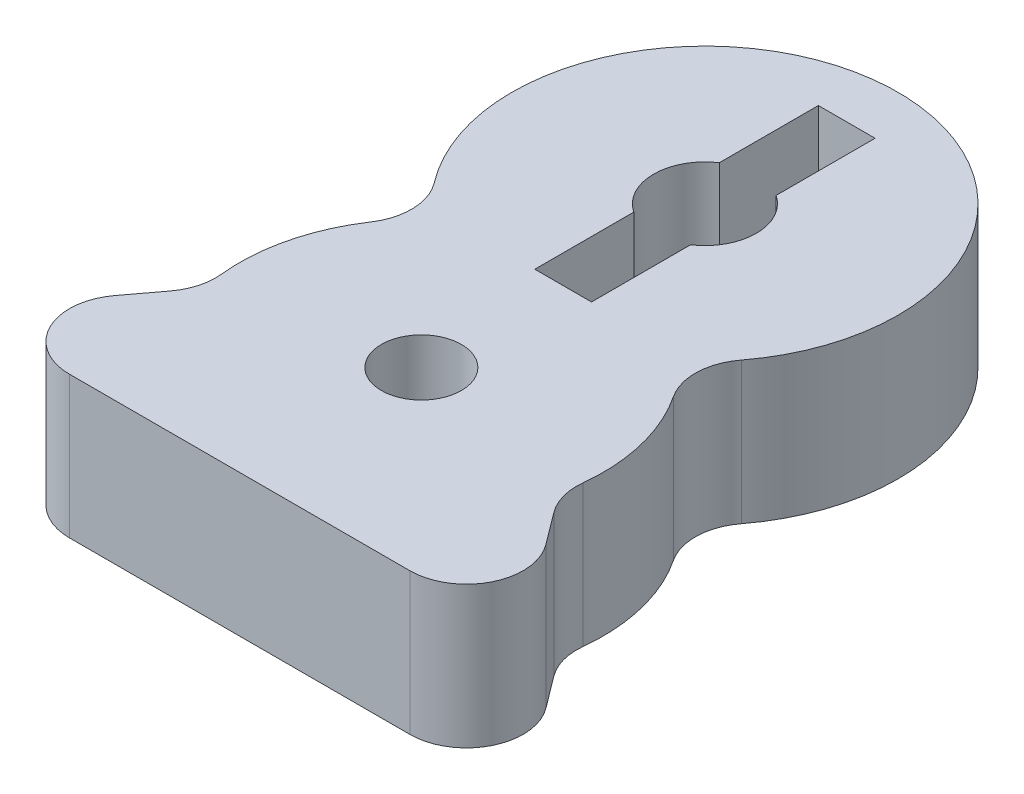
ISO-10303-21;
HEADER;
FILE_DESCRIPTION(('STEP AP214'),'2;1');
FILE_NAME('part.step','',(''),(''),'','','');
FILE_SCHEMA(('AUTOMOTIVE_DESIGN { 1 0 10303 214 1 1 1 1 }'));
ENDSEC;
DATA;
#1=APPLICATION_CONTEXT('core data for automotive mechanical design processes');
#2=APPLICATION_PROTOCOL_DEFINITION('international standard','automotive_design',2000,#1);
#3=PRODUCT_CONTEXT('',#1,'mechanical');
#4=PRODUCT('Part','Part','',(#3));
#5=PRODUCT_RELATED_PRODUCT_CATEGORY('part','',(#4));
#6=PRODUCT_DEFINITION_FORMATION('','',#4);
#7=PRODUCT_DEFINITION_CONTEXT('part definition',#1,'design');
#8=PRODUCT_DEFINITION('design','',#6,#7);
#9=PRODUCT_DEFINITION_SHAPE('','',#8);
#10=(LENGTH_UNIT() NAMED_UNIT(*) SI_UNIT(.MILLI.,.METRE.));
#11=(NAMED_UNIT(*) PLANE_ANGLE_UNIT() SI_UNIT($,.RADIAN.));
#12=(NAMED_UNIT(*) SI_UNIT($,.STERADIAN.) SOLID_ANGLE_UNIT());
#13=UNCERTAINTY_MEASURE_WITH_UNIT(LENGTH_MEASURE(1.E-05),#10,'distance_accuracy_value','');
#14=(GEOMETRIC_REPRESENTATION_CONTEXT(3) GLOBAL_UNCERTAINTY_ASSIGNED_CONTEXT((#13)) GLOBAL_UNIT_ASSIGNED_CONTEXT((#10,
#11,#12)) REPRESENTATION_CONTEXT('',''));
#15=CARTESIAN_POINT('',(0.,0.,0.));
#16=DIRECTION('',(0.,0.,1.));
#17=DIRECTION('',(1.,0.,0.));
#18=AXIS2_PLACEMENT_3D('',#15,#16,#17);
#19=CARTESIAN_POINT('',(0.,6.35,-12.7));
#20=DIRECTION('',(0.,-1.,0.));
#21=DIRECTION('',(0.,0.,-1.));
#22=AXIS2_PLACEMENT_3D('',#19,#20,#21);
#23=CYLINDRICAL_SURFACE('',#22,2.2987);
#24=DIRECTION('',(0.,-1.,0.));
#25=VECTOR('',#24,1.);
#26=CARTESIAN_POINT('',(1.27,6.35,-10.7839828575923));
#27=LINE('',#26,#25);
#28=CARTESIAN_POINT('',(1.27,6.35,-10.7839828575923));
#29=VERTEX_POINT('',#28);
#30=CARTESIAN_POINT('',(1.27,0.,-10.7839828575923));
#31=VERTEX_POINT('',#30);
#32=EDGE_CURVE('E11',#29,#31,#27,.T.);
#33=ORIENTED_EDGE('',*,*,#32,.F.);
#34=CARTESIAN_POINT('',(0.,6.35,-12.7));
#35=DIRECTION('',(0.,1.,0.));
#36=DIRECTION('',(0.,0.,1.));
#37=AXIS2_PLACEMENT_3D('',#34,#35,#36);
#38=CIRCLE('',#37,2.2987);
#39=CARTESIAN_POINT('',(1.27,6.35,-14.6160171424077));
#40=VERTEX_POINT('',#39);
#41=EDGE_CURVE('E213',#29,#40,#38,.T.);
#42=ORIENTED_EDGE('',*,*,#41,.T.);
#43=DIRECTION('',(0.,-1.,0.));
#44=VECTOR('',#43,1.);
#45=CARTESIAN_POINT('',(1.27,6.35,-14.6160171424077));
#46=LINE('',#45,#44);
#47=CARTESIAN_POINT('',(1.27,0.,-14.6160171424077));
#48=VERTEX_POINT('',#47);
#49=EDGE_CURVE('E41',#48,#40,#46,.F.);
#50=ORIENTED_EDGE('',*,*,#49,.F.);
#51=CARTESIAN_POINT('',(0.,0.,-12.7));
#52=DIRECTION('',(0.,1.,0.));
#53=DIRECTION('',(0.,0.,1.));
#54=AXIS2_PLACEMENT_3D('',#51,#52,#53);
#55=CIRCLE('',#54,2.2987);
#56=EDGE_CURVE('E217',#31,#48,#55,.T.);
#57=ORIENTED_EDGE('',*,*,#56,.F.);
#58=EDGE_LOOP('',(#33,#42,#50,#57));
#59=FACE_BOUND('',#58,.T.);
#60=ADVANCED_FACE('F33',(#59),#23,.F.);
#61=CARTESIAN_POINT('',(0.,6.35,0.));
#62=DIRECTION('',(0.,1.,0.));
#63=DIRECTION('',(0.,0.,1.));
#64=AXIS2_PLACEMENT_3D('',#61,#62,#63);
#65=PLANE('',#64);
#66=DIRECTION('',(0.,0.,-1.));
#67=VECTOR('',#66,1.);
#68=CARTESIAN_POINT('',(1.27,6.35,-19.05));
#69=LINE('',#68,#67);
#70=CARTESIAN_POINT('',(1.27,6.35,-6.35));
#71=VERTEX_POINT('',#70);
#72=EDGE_CURVE('E180',#71,#29,#69,.T.);
#73=ORIENTED_EDGE('',*,*,#72,.F.);
#74=DIRECTION('',(1.,0.,0.));
#75=VECTOR('',#74,1.);
#76=CARTESIAN_POINT('',(-1.27,6.35,-6.35));
#77=LINE('',#76,#75);
#78=CARTESIAN_POINT('',(-1.27,6.35,-6.35));
#79=VERTEX_POINT('',#78);
#80=EDGE_CURVE('E190',#79,#71,#77,.T.);
#81=ORIENTED_EDGE('',*,*,#80,.F.);
#82=DIRECTION('',(0.,0.,1.));
#83=VECTOR('',#82,1.);
#84=CARTESIAN_POINT('',(-1.27,6.35,-19.05));
#85=LINE('',#84,#83);
#86=CARTESIAN_POINT('',(-1.27,6.35,-10.7839828575923));
#87=VERTEX_POINT('',#86);
#88=EDGE_CURVE('E196',#87,#79,#85,.T.);
#89=ORIENTED_EDGE('',*,*,#88,.F.);
#90=CARTESIAN_POINT('',(-1.27,6.35,-14.6160171424077));
#91=VERTEX_POINT('',#90);
#92=EDGE_CURVE('E216',#91,#87,#38,.T.);
#93=ORIENTED_EDGE('',*,*,#92,.F.);
#94=CARTESIAN_POINT('',(-1.27,6.35,-19.05));
#95=VERTEX_POINT('',#94);
#96=EDGE_CURVE('E56',#95,#91,#85,.T.);
#97=ORIENTED_EDGE('',*,*,#96,.F.);
#98=DIRECTION('',(-1.,0.,0.));
#99=VECTOR('',#98,1.);
#100=CARTESIAN_POINT('',(-1.27,6.35,-19.05));
#101=LINE('',#100,#99);
#102=CARTESIAN_POINT('',(1.27,6.35,-19.05));
#103=VERTEX_POINT('',#102);
#104=EDGE_CURVE('E186',#103,#95,#101,.T.);
#105=ORIENTED_EDGE('',*,*,#104,.F.);
#106=EDGE_CURVE('E170',#40,#103,#69,.T.);
#107=ORIENTED_EDGE('',*,*,#106,.F.);
#108=ORIENTED_EDGE('',*,*,#41,.F.);
#109=EDGE_LOOP('',(#73,#81,#89,#93,#97,#105,#107,#108));
#110=FACE_BOUND('',#109,.T.);
#111=CARTESIAN_POINT('',(0.,6.35,0.));
#112=DIRECTION('',(0.,1.,0.));
#113=DIRECTION('',(0.,0.,1.));
#114=AXIS2_PLACEMENT_3D('',#111,#112,#113);
#115=CIRCLE('',#114,1.7907);
#116=CARTESIAN_POINT('',(0.,6.35,1.7907));
#117=VERTEX_POINT('',#116);
#118=EDGE_CURVE('E220',#117,#117,#115,.T.);
#119=ORIENTED_EDGE('',*,*,#118,.F.);
#120=EDGE_LOOP('',(#119));
#121=FACE_BOUND('',#120,.T.);
#122=DIRECTION('',(1.,0.,0.));
#123=VECTOR('',#122,1.);
#124=CARTESIAN_POINT('',(-12.7,6.35,8.1407));
#125=LINE('',#124,#123);
#126=CARTESIAN_POINT('',(-7.62243758102325,6.35,8.1407));
#127=VERTEX_POINT('',#126);
#128=CARTESIAN_POINT('',(7.62243758102325,6.35,8.1407));
#129=VERTEX_POINT('',#128);
#130=EDGE_CURVE('E229',#127,#129,#125,.T.);
#131=ORIENTED_EDGE('',*,*,#130,.T.);
#132=CARTESIAN_POINT('',(7.62243758102325,6.35,5.6007));
#133=DIRECTION('',(0.,1.,0.));
#134=DIRECTION('',(0.,0.,1.));
#135=AXIS2_PLACEMENT_3D('',#132,#133,#134);
#136=CIRCLE('',#135,2.54);
#137=CARTESIAN_POINT('',(9.65502267527583,6.35,4.07748043781527));
#138=VERTEX_POINT('',#137);
#139=EDGE_CURVE('E277',#129,#138,#136,.T.);
#140=ORIENTED_EDGE('',*,*,#139,.T.);
#141=DIRECTION('',(-0.599692741017609,0.,-0.800230352067944));
#142=VECTOR('',#141,1.);
#143=CARTESIAN_POINT('',(12.7,6.35,8.1407));
#144=LINE('',#143,#142);
#145=CARTESIAN_POINT('',(8.58810980374421,6.35,2.65379126431818));
#146=VERTEX_POINT('',#145);
#147=EDGE_CURVE('E233',#138,#146,#144,.T.);
#148=ORIENTED_EDGE('',*,*,#147,.T.);
#149=CARTESIAN_POINT('',(10.6206948979968,6.35,1.13057170213345));
#150=DIRECTION('',(0.,1.,0.));
#151=DIRECTION('',(0.,0.,1.));
#152=AXIS2_PLACEMENT_3D('',#149,#150,#151);
#153=CIRCLE('',#152,2.54);
#154=CARTESIAN_POINT('',(8.09496483902015,6.35,0.861708039319313));
#155=VERTEX_POINT('',#154);
#156=EDGE_CURVE('E313',#146,#155,#153,.F.);
#157=ORIENTED_EDGE('',*,*,#156,.T.);
#158=CARTESIAN_POINT('',(0.,6.35,0.));
#159=DIRECTION('',(0.,1.,0.));
#160=DIRECTION('',(0.,0.,1.));
#161=AXIS2_PLACEMENT_3D('',#158,#159,#160);
#162=CIRCLE('',#161,8.1407);
#163=CARTESIAN_POINT('',(6.7795474452669,6.35,-4.50652115576695));
#164=VERTEX_POINT('',#163);
#165=EDGE_CURVE('E236',#155,#164,#162,.T.);
#166=ORIENTED_EDGE('',*,*,#165,.T.);
#167=CARTESIAN_POINT('',(8.89485086032678,6.35,-5.912612));
#168=DIRECTION('',(0.,1.,0.));
#169=DIRECTION('',(0.,0.,1.));
#170=AXIS2_PLACEMENT_3D('',#167,#168,#169);
#171=CIRCLE('',#170,2.54);
#172=CARTESIAN_POINT('',(6.87558846297677,6.35,-7.45344923041998));
#173=VERTEX_POINT('',#172);
#174=EDGE_CURVE('E309',#164,#173,#171,.F.);
#175=ORIENTED_EDGE('',*,*,#174,.T.);
#176=CARTESIAN_POINT('',(0.,6.35,-12.7));
#177=DIRECTION('',(0.,1.,0.));
#178=DIRECTION('',(0.,0.,1.));
#179=AXIS2_PLACEMENT_3D('',#176,#177,#178);
#180=CIRCLE('',#179,8.6487);
#181=CARTESIAN_POINT('',(-6.87558846297677,6.35,-7.45344923041998));
#182=VERTEX_POINT('',#181);
#183=EDGE_CURVE('E239',#173,#182,#180,.T.);
#184=ORIENTED_EDGE('',*,*,#183,.T.);
#185=CARTESIAN_POINT('',(-8.89485086032678,6.35,-5.912612));
#186=DIRECTION('',(0.,1.,0.));
#187=DIRECTION('',(0.,0.,1.));
#188=AXIS2_PLACEMENT_3D('',#185,#186,#187);
#189=CIRCLE('',#188,2.54);
#190=CARTESIAN_POINT('',(-6.7795474452669,6.35,-4.50652115576695));
#191=VERTEX_POINT('',#190);
#192=EDGE_CURVE('E305',#182,#191,#189,.F.);
#193=ORIENTED_EDGE('',*,*,#192,.T.);
#194=CARTESIAN_POINT('',(0.,6.35,0.));
#195=DIRECTION('',(0.,1.,0.));
#196=DIRECTION('',(0.,0.,1.));
#197=AXIS2_PLACEMENT_3D('',#194,#195,#196);
#198=CIRCLE('',#197,8.1407);
#199=CARTESIAN_POINT('',(-8.09496483902015,6.35,0.861708039319313));
#200=VERTEX_POINT('',#199);
#201=EDGE_CURVE('E242',#191,#200,#198,.T.);
#202=ORIENTED_EDGE('',*,*,#201,.T.);
#203=CARTESIAN_POINT('',(-10.6206948979968,6.35,1.13057170213345));
#204=DIRECTION('',(0.,1.,0.));
#205=DIRECTION('',(0.,0.,1.));
#206=AXIS2_PLACEMENT_3D('',#203,#204,#205);
#207=CIRCLE('',#206,2.54);
#208=CARTESIAN_POINT('',(-8.58810980374421,6.35,2.65379126431818));
#209=VERTEX_POINT('',#208);
#210=EDGE_CURVE('E301',#200,#209,#207,.F.);
#211=ORIENTED_EDGE('',*,*,#210,.T.);
#212=DIRECTION('',(-0.599692741017609,0.,0.800230352067944));
#213=VECTOR('',#212,1.);
#214=CARTESIAN_POINT('',(-12.7,6.35,8.1407));
#215=LINE('',#214,#213);
#216=CARTESIAN_POINT('',(-9.65502267527583,6.35,4.07748043781527));
#217=VERTEX_POINT('',#216);
#218=EDGE_CURVE('E226',#209,#217,#215,.T.);
#219=ORIENTED_EDGE('',*,*,#218,.T.);
#220=CARTESIAN_POINT('',(-7.62243758102325,6.35,5.6007));
#221=DIRECTION('',(0.,1.,0.));
#222=DIRECTION('',(0.,0.,1.));
#223=AXIS2_PLACEMENT_3D('',#220,#221,#222);
#224=CIRCLE('',#223,2.54);
#225=EDGE_CURVE('E275',#217,#127,#224,.T.);
#226=ORIENTED_EDGE('',*,*,#225,.T.);
#227=EDGE_LOOP('',(#131,#140,#148,#157,#166,#175,#184,#193,#202,#211,#219,#226));
#228=FACE_BOUND('',#227,.T.);
#229=ADVANCED_FACE('F193',(#110,#121,#228),#65,.T.);
#230=CARTESIAN_POINT('',(0.,0.,0.));
#231=DIRECTION('',(0.,1.,0.));
#232=DIRECTION('',(0.,0.,1.));
#233=AXIS2_PLACEMENT_3D('',#230,#231,#232);
#234=PLANE('',#233);
#235=DIRECTION('',(-1.,0.,0.));
#236=VECTOR('',#235,1.);
#237=CARTESIAN_POINT('',(-1.27,0.,-6.35));
#238=LINE('',#237,#236);
#239=CARTESIAN_POINT('',(1.27,0.,-6.35));
#240=VERTEX_POINT('',#239);
#241=CARTESIAN_POINT('',(-1.27,0.,-6.35));
#242=VERTEX_POINT('',#241);
#243=EDGE_CURVE('E336',#240,#242,#238,.T.);
#244=ORIENTED_EDGE('',*,*,#243,.F.);
#245=DIRECTION('',(0.,0.,1.));
#246=VECTOR('',#245,1.);
#247=CARTESIAN_POINT('',(1.27,0.,-19.05));
#248=LINE('',#247,#246);
#249=EDGE_CURVE('E338',#31,#240,#248,.T.);
#250=ORIENTED_EDGE('',*,*,#249,.F.);
#251=ORIENTED_EDGE('',*,*,#56,.T.);
#252=CARTESIAN_POINT('',(1.27,0.,-19.05));
#253=VERTEX_POINT('',#252);
#254=EDGE_CURVE('E212',#253,#48,#248,.T.);
#255=ORIENTED_EDGE('',*,*,#254,.F.);
#256=DIRECTION('',(1.,0.,0.));
#257=VECTOR('',#256,1.);
#258=CARTESIAN_POINT('',(-1.27,0.,-19.05));
#259=LINE('',#258,#257);
#260=CARTESIAN_POINT('',(-1.27,0.,-19.05));
#261=VERTEX_POINT('',#260);
#262=EDGE_CURVE('E188',#261,#253,#259,.T.);
#263=ORIENTED_EDGE('',*,*,#262,.F.);
#264=DIRECTION('',(0.,0.,-1.));
#265=VECTOR('',#264,1.);
#266=CARTESIAN_POINT('',(-1.27,0.,-19.05));
#267=LINE('',#266,#265);
#268=CARTESIAN_POINT('',(-1.27,0.,-14.6160171424077));
#269=VERTEX_POINT('',#268);
#270=EDGE_CURVE('E205',#269,#261,#267,.T.);
#271=ORIENTED_EDGE('',*,*,#270,.F.);
#272=CARTESIAN_POINT('',(-1.27,0.,-10.7839828575923));
#273=VERTEX_POINT('',#272);
#274=EDGE_CURVE('E211',#269,#273,#55,.T.);
#275=ORIENTED_EDGE('',*,*,#274,.T.);
#276=EDGE_CURVE('E48',#242,#273,#267,.T.);
#277=ORIENTED_EDGE('',*,*,#276,.F.);
#278=EDGE_LOOP('',(#244,#250,#251,#255,#263,#271,#275,#277));
#279=FACE_BOUND('',#278,.T.);
#280=CARTESIAN_POINT('',(0.,0.,0.));
#281=DIRECTION('',(0.,1.,0.));
#282=DIRECTION('',(0.,0.,1.));
#283=AXIS2_PLACEMENT_3D('',#280,#281,#282);
#284=CIRCLE('',#283,1.7907);
#285=CARTESIAN_POINT('',(0.,0.,1.7907));
#286=VERTEX_POINT('',#285);
#287=EDGE_CURVE('E215',#286,#286,#284,.T.);
#288=ORIENTED_EDGE('',*,*,#287,.T.);
#289=EDGE_LOOP('',(#288));
#290=FACE_BOUND('',#289,.T.);
#291=DIRECTION('',(-0.599692741017609,0.,-0.800230352067944));
#292=VECTOR('',#291,1.);
#293=CARTESIAN_POINT('',(12.7,0.,8.1407));
#294=LINE('',#293,#292);
#295=CARTESIAN_POINT('',(9.65502267527583,0.,4.07748043781527));
#296=VERTEX_POINT('',#295);
#297=CARTESIAN_POINT('',(8.58810980374421,0.,2.65379126431818));
#298=VERTEX_POINT('',#297);
#299=EDGE_CURVE('E251',#296,#298,#294,.T.);
#300=ORIENTED_EDGE('',*,*,#299,.F.);
#301=CARTESIAN_POINT('',(7.62243758102325,0.,5.6007));
#302=DIRECTION('',(0.,1.,0.));
#303=DIRECTION('',(0.,0.,1.));
#304=AXIS2_PLACEMENT_3D('',#301,#302,#303);
#305=CIRCLE('',#304,2.54);
#306=CARTESIAN_POINT('',(7.62243758102325,0.,8.1407));
#307=VERTEX_POINT('',#306);
#308=EDGE_CURVE('E268',#296,#307,#305,.F.);
#309=ORIENTED_EDGE('',*,*,#308,.T.);
#310=DIRECTION('',(1.,0.,0.));
#311=VECTOR('',#310,1.);
#312=CARTESIAN_POINT('',(-12.7,0.,8.1407));
#313=LINE('',#312,#311);
#314=CARTESIAN_POINT('',(-7.62243758102325,0.,8.1407));
#315=VERTEX_POINT('',#314);
#316=EDGE_CURVE('E248',#315,#307,#313,.T.);
#317=ORIENTED_EDGE('',*,*,#316,.F.);
#318=CARTESIAN_POINT('',(-7.62243758102325,0.,5.6007));
#319=DIRECTION('',(0.,1.,0.));
#320=DIRECTION('',(0.,0.,1.));
#321=AXIS2_PLACEMENT_3D('',#318,#319,#320);
#322=CIRCLE('',#321,2.54);
#323=CARTESIAN_POINT('',(-9.65502267527583,0.,4.07748043781527));
#324=VERTEX_POINT('',#323);
#325=EDGE_CURVE('E266',#315,#324,#322,.F.);
#326=ORIENTED_EDGE('',*,*,#325,.T.);
#327=DIRECTION('',(-0.599692741017609,0.,0.800230352067944));
#328=VECTOR('',#327,1.);
#329=CARTESIAN_POINT('',(-12.7,0.,8.1407));
#330=LINE('',#329,#328);
#331=CARTESIAN_POINT('',(-8.58810980374421,0.,2.65379126431818));
#332=VERTEX_POINT('',#331);
#333=EDGE_CURVE('E223',#332,#324,#330,.T.);
#334=ORIENTED_EDGE('',*,*,#333,.F.);
#335=CARTESIAN_POINT('',(-10.6206948979968,0.,1.13057170213345));
#336=DIRECTION('',(0.,1.,0.));
#337=DIRECTION('',(0.,0.,1.));
#338=AXIS2_PLACEMENT_3D('',#335,#336,#337);
#339=CIRCLE('',#338,2.54);
#340=CARTESIAN_POINT('',(-8.09496483902015,0.,0.861708039319313));
#341=VERTEX_POINT('',#340);
#342=EDGE_CURVE('E299',#332,#341,#339,.T.);
#343=ORIENTED_EDGE('',*,*,#342,.T.);
#344=CARTESIAN_POINT('',(0.,0.,0.));
#345=DIRECTION('',(0.,1.,0.));
#346=DIRECTION('',(0.,0.,1.));
#347=AXIS2_PLACEMENT_3D('',#344,#345,#346);
#348=CIRCLE('',#347,8.1407);
#349=CARTESIAN_POINT('',(-6.7795474452669,0.,-4.50652115576695));
#350=VERTEX_POINT('',#349);
#351=EDGE_CURVE('E230',#350,#341,#348,.T.);
#352=ORIENTED_EDGE('',*,*,#351,.F.);
#353=CARTESIAN_POINT('',(-8.89485086032678,0.,-5.912612));
#354=DIRECTION('',(0.,1.,0.));
#355=DIRECTION('',(0.,0.,1.));
#356=AXIS2_PLACEMENT_3D('',#353,#354,#355);
#357=CIRCLE('',#356,2.54);
#358=CARTESIAN_POINT('',(-6.87558846297677,0.,-7.45344923041998));
#359=VERTEX_POINT('',#358);
#360=EDGE_CURVE('E303',#350,#359,#357,.T.);
#361=ORIENTED_EDGE('',*,*,#360,.T.);
#362=CARTESIAN_POINT('',(0.,0.,-12.7));
#363=DIRECTION('',(0.,1.,0.));
#364=DIRECTION('',(0.,0.,1.));
#365=AXIS2_PLACEMENT_3D('',#362,#363,#364);
#366=CIRCLE('',#365,8.6487);
#367=CARTESIAN_POINT('',(6.87558846297677,0.,-7.45344923041998));
#368=VERTEX_POINT('',#367);
#369=EDGE_CURVE('E257',#368,#359,#366,.T.);
#370=ORIENTED_EDGE('',*,*,#369,.F.);
#371=CARTESIAN_POINT('',(8.89485086032678,0.,-5.912612));
#372=DIRECTION('',(0.,1.,0.));
#373=DIRECTION('',(0.,0.,1.));
#374=AXIS2_PLACEMENT_3D('',#371,#372,#373);
#375=CIRCLE('',#374,2.54);
#376=CARTESIAN_POINT('',(6.7795474452669,0.,-4.50652115576695));
#377=VERTEX_POINT('',#376);
#378=EDGE_CURVE('E307',#368,#377,#375,.T.);
#379=ORIENTED_EDGE('',*,*,#378,.T.);
#380=CARTESIAN_POINT('',(0.,0.,0.));
#381=DIRECTION('',(0.,1.,0.));
#382=DIRECTION('',(0.,0.,1.));
#383=AXIS2_PLACEMENT_3D('',#380,#381,#382);
#384=CIRCLE('',#383,8.1407);
#385=CARTESIAN_POINT('',(8.09496483902015,0.,0.861708039319313));
#386=VERTEX_POINT('',#385);
#387=EDGE_CURVE('E254',#386,#377,#384,.T.);
#388=ORIENTED_EDGE('',*,*,#387,.F.);
#389=CARTESIAN_POINT('',(10.6206948979968,0.,1.13057170213345));
#390=DIRECTION('',(0.,1.,0.));
#391=DIRECTION('',(0.,0.,1.));
#392=AXIS2_PLACEMENT_3D('',#389,#390,#391);
#393=CIRCLE('',#392,2.54);
#394=EDGE_CURVE('E311',#386,#298,#393,.T.);
#395=ORIENTED_EDGE('',*,*,#394,.T.);
#396=EDGE_LOOP('',(#300,#309,#317,#326,#334,#343,#352,#361,#370,#379,#388,#395));
#397=FACE_BOUND('',#396,.T.);
#398=ADVANCED_FACE('F326',(#279,#290,#397),#234,.F.);
#399=CARTESIAN_POINT('',(-12.7,6.35,8.1407));
#400=DIRECTION('',(0.800230352067944,0.,0.599692741017609));
#401=DIRECTION('',(0.599692741017609,0.,-0.800230352067944));
#402=AXIS2_PLACEMENT_3D('',#399,#400,#401);
#403=PLANE('',#402);
#404=ORIENTED_EDGE('',*,*,#333,.T.);
#405=DIRECTION('',(0.,-1.,0.));
#406=VECTOR('',#405,1.);
#407=CARTESIAN_POINT('',(-9.65502267527583,6.35,4.07748043781527));
#408=LINE('',#407,#406);
#409=EDGE_CURVE('E282',#324,#217,#408,.F.);
#410=ORIENTED_EDGE('',*,*,#409,.T.);
#411=ORIENTED_EDGE('',*,*,#218,.F.);
#412=DIRECTION('',(0.,1.,0.));
#413=VECTOR('',#412,1.);
#414=CARTESIAN_POINT('',(-8.58810980374421,0.,2.65379126431818));
#415=LINE('',#414,#413);
#416=EDGE_CURVE('E279',#209,#332,#415,.F.);
#417=ORIENTED_EDGE('',*,*,#416,.T.);
#418=EDGE_LOOP('',(#404,#410,#411,#417));
#419=FACE_BOUND('',#418,.T.);
#420=ADVANCED_FACE('F376',(#419),#403,.F.);
#421=CARTESIAN_POINT('',(-12.7,6.35,8.1407));
#422=DIRECTION('',(0.,0.,-1.));
#423=DIRECTION('',(-1.,0.,0.));
#424=AXIS2_PLACEMENT_3D('',#421,#422,#423);
#425=PLANE('',#424);
#426=ORIENTED_EDGE('',*,*,#316,.T.);
#427=DIRECTION('',(0.,-1.,0.));
#428=VECTOR('',#427,1.);
#429=CARTESIAN_POINT('',(7.62243758102325,6.35,8.1407));
#430=LINE('',#429,#428);
#431=EDGE_CURVE('E273',#307,#129,#430,.F.);
#432=ORIENTED_EDGE('',*,*,#431,.T.);
#433=ORIENTED_EDGE('',*,*,#130,.F.);
#434=DIRECTION('',(0.,-1.,0.));
#435=VECTOR('',#434,1.);
#436=CARTESIAN_POINT('',(-7.62243758102325,6.35,8.1407));
#437=LINE('',#436,#435);
#438=EDGE_CURVE('E270',#127,#315,#437,.T.);
#439=ORIENTED_EDGE('',*,*,#438,.T.);
#440=EDGE_LOOP('',(#426,#432,#433,#439));
#441=FACE_BOUND('',#440,.T.);
#442=ADVANCED_FACE('F388',(#441),#425,.F.);
#443=CARTESIAN_POINT('',(12.7,6.35,8.1407));
#444=DIRECTION('',(-0.800230352067944,0.,0.599692741017609));
#445=DIRECTION('',(0.599692741017609,0.,0.800230352067944));
#446=AXIS2_PLACEMENT_3D('',#443,#444,#445);
#447=PLANE('',#446);
#448=ORIENTED_EDGE('',*,*,#147,.F.);
#449=DIRECTION('',(0.,-1.,0.));
#450=VECTOR('',#449,1.);
#451=CARTESIAN_POINT('',(9.65502267527583,6.35,4.07748043781527));
#452=LINE('',#451,#450);
#453=EDGE_CURVE('E263',#138,#296,#452,.T.);
#454=ORIENTED_EDGE('',*,*,#453,.T.);
#455=ORIENTED_EDGE('',*,*,#299,.T.);
#456=DIRECTION('',(0.,1.,0.));
#457=VECTOR('',#456,1.);
#458=CARTESIAN_POINT('',(8.58810980374421,6.35,2.65379126431818));
#459=LINE('',#458,#457);
#460=EDGE_CURVE('E245',#298,#146,#459,.T.);
#461=ORIENTED_EDGE('',*,*,#460,.T.);
#462=EDGE_LOOP('',(#448,#454,#455,#461));
#463=FACE_BOUND('',#462,.T.);
#464=ADVANCED_FACE('F384',(#463),#447,.F.);
#465=CARTESIAN_POINT('',(0.,6.35,0.));
#466=DIRECTION('',(0.,-1.,0.));
#467=DIRECTION('',(0.,0.,-1.));
#468=AXIS2_PLACEMENT_3D('',#465,#466,#467);
#469=CYLINDRICAL_SURFACE('',#468,8.1407);
#470=ORIENTED_EDGE('',*,*,#387,.T.);
#471=DIRECTION('',(0.,-1.,0.));
#472=VECTOR('',#471,1.);
#473=CARTESIAN_POINT('',(6.7795474452669,6.35,-4.50652115576695));
#474=LINE('',#473,#472);
#475=EDGE_CURVE('E297',#377,#164,#474,.F.);
#476=ORIENTED_EDGE('',*,*,#475,.T.);
#477=ORIENTED_EDGE('',*,*,#165,.F.);
#478=DIRECTION('',(0.,-1.,0.));
#479=VECTOR('',#478,1.);
#480=CARTESIAN_POINT('',(8.09496483902015,6.35,0.861708039319313));
#481=LINE('',#480,#479);
#482=EDGE_CURVE('E294',#155,#386,#481,.T.);
#483=ORIENTED_EDGE('',*,*,#482,.T.);
#484=EDGE_LOOP('',(#470,#476,#477,#483));
#485=FACE_BOUND('',#484,.T.);
#486=ADVANCED_FACE('F380',(#485),#469,.T.);
#487=CARTESIAN_POINT('',(0.,6.35,-12.7));
#488=DIRECTION('',(0.,-1.,0.));
#489=DIRECTION('',(0.,0.,-1.));
#490=AXIS2_PLACEMENT_3D('',#487,#488,#489);
#491=CYLINDRICAL_SURFACE('',#490,8.6487);
#492=ORIENTED_EDGE('',*,*,#369,.T.);
#493=DIRECTION('',(0.,-1.,0.));
#494=VECTOR('',#493,1.);
#495=CARTESIAN_POINT('',(-6.87558846297677,6.35,-7.45344923041998));
#496=LINE('',#495,#494);
#497=EDGE_CURVE('E292',#359,#182,#496,.F.);
#498=ORIENTED_EDGE('',*,*,#497,.T.);
#499=ORIENTED_EDGE('',*,*,#183,.F.);
#500=DIRECTION('',(0.,-1.,0.));
#501=VECTOR('',#500,1.);
#502=CARTESIAN_POINT('',(6.87558846297677,6.35,-7.45344923041998));
#503=LINE('',#502,#501);
#504=EDGE_CURVE('E289',#173,#368,#503,.T.);
#505=ORIENTED_EDGE('',*,*,#504,.T.);
#506=EDGE_LOOP('',(#492,#498,#499,#505));
#507=FACE_BOUND('',#506,.T.);
#508=ADVANCED_FACE('F371',(#507),#491,.T.);
#509=CARTESIAN_POINT('',(0.,6.35,0.));
#510=DIRECTION('',(0.,-1.,0.));
#511=DIRECTION('',(0.,0.,-1.));
#512=AXIS2_PLACEMENT_3D('',#509,#510,#511);
#513=CYLINDRICAL_SURFACE('',#512,8.1407);
#514=ORIENTED_EDGE('',*,*,#351,.T.);
#515=DIRECTION('',(0.,-1.,0.));
#516=VECTOR('',#515,1.);
#517=CARTESIAN_POINT('',(-8.09496483902015,6.35,0.861708039319313));
#518=LINE('',#517,#516);
#519=EDGE_CURVE('E287',#341,#200,#518,.F.);
#520=ORIENTED_EDGE('',*,*,#519,.T.);
#521=ORIENTED_EDGE('',*,*,#201,.F.);
#522=DIRECTION('',(0.,-1.,0.));
#523=VECTOR('',#522,1.);
#524=CARTESIAN_POINT('',(-6.7795474452669,6.35,-4.50652115576695));
#525=LINE('',#524,#523);
#526=EDGE_CURVE('E284',#191,#350,#525,.T.);
#527=ORIENTED_EDGE('',*,*,#526,.T.);
#528=EDGE_LOOP('',(#514,#520,#521,#527));
#529=FACE_BOUND('',#528,.T.);
#530=ADVANCED_FACE('F366',(#529),#513,.T.);
#531=CARTESIAN_POINT('',(0.,6.35,0.));
#532=DIRECTION('',(0.,-1.,0.));
#533=DIRECTION('',(0.,0.,-1.));
#534=AXIS2_PLACEMENT_3D('',#531,#532,#533);
#535=CYLINDRICAL_SURFACE('',#534,1.7907);
#536=ORIENTED_EDGE('',*,*,#118,.T.);
#537=EDGE_LOOP('',(#536));
#538=FACE_BOUND('',#537,.T.);
#539=ORIENTED_EDGE('',*,*,#287,.F.);
#540=EDGE_LOOP('',(#539));
#541=FACE_BOUND('',#540,.T.);
#542=ADVANCED_FACE('F356',(#538,#541),#535,.F.);
#543=DIRECTION('',(0.,-1.,0.));
#544=VECTOR('',#543,1.);
#545=CARTESIAN_POINT('',(-1.27,6.35,-14.6160171424077));
#546=LINE('',#545,#544);
#547=EDGE_CURVE('E317',#91,#269,#546,.T.);
#548=ORIENTED_EDGE('',*,*,#547,.F.);
#549=ORIENTED_EDGE('',*,*,#92,.T.);
#550=DIRECTION('',(0.,-1.,0.));
#551=VECTOR('',#550,1.);
#552=CARTESIAN_POINT('',(-1.27,6.35,-10.7839828575923));
#553=LINE('',#552,#551);
#554=EDGE_CURVE('E315',#273,#87,#553,.F.);
#555=ORIENTED_EDGE('',*,*,#554,.F.);
#556=ORIENTED_EDGE('',*,*,#274,.F.);
#557=EDGE_LOOP('',(#548,#549,#555,#556));
#558=FACE_BOUND('',#557,.T.);
#559=ADVANCED_FACE('F329',(#558),#23,.F.);
#560=CARTESIAN_POINT('',(7.62243758102325,6.35,5.6007));
#561=DIRECTION('',(0.,-1.,0.));
#562=DIRECTION('',(0.,0.,-1.));
#563=AXIS2_PLACEMENT_3D('',#560,#561,#562);
#564=CYLINDRICAL_SURFACE('',#563,2.54);
#565=ORIENTED_EDGE('',*,*,#139,.F.);
#566=ORIENTED_EDGE('',*,*,#431,.F.);
#567=ORIENTED_EDGE('',*,*,#308,.F.);
#568=ORIENTED_EDGE('',*,*,#453,.F.);
#569=EDGE_LOOP('',(#565,#566,#567,#568));
#570=FACE_BOUND('',#569,.T.);
#571=ADVANCED_FACE('F355',(#570),#564,.T.);
#572=CARTESIAN_POINT('',(-7.62243758102325,6.35,5.6007));
#573=DIRECTION('',(0.,-1.,0.));
#574=DIRECTION('',(0.,0.,-1.));
#575=AXIS2_PLACEMENT_3D('',#572,#573,#574);
#576=CYLINDRICAL_SURFACE('',#575,2.54);
#577=ORIENTED_EDGE('',*,*,#225,.F.);
#578=ORIENTED_EDGE('',*,*,#409,.F.);
#579=ORIENTED_EDGE('',*,*,#325,.F.);
#580=ORIENTED_EDGE('',*,*,#438,.F.);
#581=EDGE_LOOP('',(#577,#578,#579,#580));
#582=FACE_BOUND('',#581,.T.);
#583=ADVANCED_FACE('F362',(#582),#576,.T.);
#584=CARTESIAN_POINT('',(-10.6206948979968,6.35,1.13057170213345));
#585=DIRECTION('',(0.,-1.,0.));
#586=DIRECTION('',(0.,0.,-1.));
#587=AXIS2_PLACEMENT_3D('',#584,#585,#586);
#588=CYLINDRICAL_SURFACE('',#587,2.54);
#589=ORIENTED_EDGE('',*,*,#210,.F.);
#590=ORIENTED_EDGE('',*,*,#519,.F.);
#591=ORIENTED_EDGE('',*,*,#342,.F.);
#592=ORIENTED_EDGE('',*,*,#416,.F.);
#593=EDGE_LOOP('',(#589,#590,#591,#592));
#594=FACE_BOUND('',#593,.T.);
#595=ADVANCED_FACE('F398',(#594),#588,.F.);
#596=CARTESIAN_POINT('',(-8.89485086032678,6.35,-5.912612));
#597=DIRECTION('',(0.,1.,0.));
#598=DIRECTION('',(0.,0.,1.));
#599=AXIS2_PLACEMENT_3D('',#596,#597,#598);
#600=CYLINDRICAL_SURFACE('',#599,2.54);
#601=ORIENTED_EDGE('',*,*,#192,.F.);
#602=ORIENTED_EDGE('',*,*,#497,.F.);
#603=ORIENTED_EDGE('',*,*,#360,.F.);
#604=ORIENTED_EDGE('',*,*,#526,.F.);
#605=EDGE_LOOP('',(#601,#602,#603,#604));
#606=FACE_BOUND('',#605,.T.);
#607=ADVANCED_FACE('F402',(#606),#600,.F.);
#608=CARTESIAN_POINT('',(8.89485086032678,6.35,-5.912612));
#609=DIRECTION('',(0.,1.,0.));
#610=DIRECTION('',(0.,0.,1.));
#611=AXIS2_PLACEMENT_3D('',#608,#609,#610);
#612=CYLINDRICAL_SURFACE('',#611,2.54);
#613=ORIENTED_EDGE('',*,*,#174,.F.);
#614=ORIENTED_EDGE('',*,*,#475,.F.);
#615=ORIENTED_EDGE('',*,*,#378,.F.);
#616=ORIENTED_EDGE('',*,*,#504,.F.);
#617=EDGE_LOOP('',(#613,#614,#615,#616));
#618=FACE_BOUND('',#617,.T.);
#619=ADVANCED_FACE('F405',(#618),#612,.F.);
#620=CARTESIAN_POINT('',(10.6206948979968,6.35,1.13057170213345));
#621=DIRECTION('',(0.,-1.,0.));
#622=DIRECTION('',(0.,0.,-1.));
#623=AXIS2_PLACEMENT_3D('',#620,#621,#622);
#624=CYLINDRICAL_SURFACE('',#623,2.54);
#625=ORIENTED_EDGE('',*,*,#156,.F.);
#626=ORIENTED_EDGE('',*,*,#460,.F.);
#627=ORIENTED_EDGE('',*,*,#394,.F.);
#628=ORIENTED_EDGE('',*,*,#482,.F.);
#629=EDGE_LOOP('',(#625,#626,#627,#628));
#630=FACE_BOUND('',#629,.T.);
#631=ADVANCED_FACE('F35',(#630),#624,.F.);
#632=CARTESIAN_POINT('',(-1.27,-12.9515095645257,-19.05));
#633=DIRECTION('',(-1.,0.,0.));
#634=DIRECTION('',(0.,0.,1.));
#635=AXIS2_PLACEMENT_3D('',#632,#633,#634);
#636=PLANE('',#635);
#637=ORIENTED_EDGE('',*,*,#554,.T.);
#638=ORIENTED_EDGE('',*,*,#88,.T.);
#639=DIRECTION('',(0.,1.,0.));
#640=VECTOR('',#639,1.);
#641=CARTESIAN_POINT('',(-1.27,-12.9515095645257,-6.35));
#642=LINE('',#641,#640);
#643=EDGE_CURVE('E206',#242,#79,#642,.T.);
#644=ORIENTED_EDGE('',*,*,#643,.F.);
#645=ORIENTED_EDGE('',*,*,#276,.T.);
#646=EDGE_LOOP('',(#637,#638,#644,#645));
#647=FACE_BOUND('',#646,.T.);
#648=ADVANCED_FACE('F331',(#647),#636,.F.);
#649=CARTESIAN_POINT('',(1.27,-12.9515095645257,-19.05));
#650=DIRECTION('',(1.,0.,0.));
#651=DIRECTION('',(0.,0.,-1.));
#652=AXIS2_PLACEMENT_3D('',#649,#650,#651);
#653=PLANE('',#652);
#654=ORIENTED_EDGE('',*,*,#32,.T.);
#655=ORIENTED_EDGE('',*,*,#249,.T.);
#656=DIRECTION('',(0.,1.,0.));
#657=VECTOR('',#656,1.);
#658=CARTESIAN_POINT('',(1.27,-12.9515095645257,-6.35));
#659=LINE('',#658,#657);
#660=EDGE_CURVE('E203',#240,#71,#659,.T.);
#661=ORIENTED_EDGE('',*,*,#660,.T.);
#662=ORIENTED_EDGE('',*,*,#72,.T.);
#663=EDGE_LOOP('',(#654,#655,#661,#662));
#664=FACE_BOUND('',#663,.T.);
#665=ADVANCED_FACE('F341',(#664),#653,.F.);
#666=CARTESIAN_POINT('',(-1.27,-12.9515095645257,-6.35));
#667=DIRECTION('',(0.,0.,1.));
#668=DIRECTION('',(1.,0.,0.));
#669=AXIS2_PLACEMENT_3D('',#666,#667,#668);
#670=PLANE('',#669);
#671=ORIENTED_EDGE('',*,*,#243,.T.);
#672=ORIENTED_EDGE('',*,*,#643,.T.);
#673=ORIENTED_EDGE('',*,*,#80,.T.);
#674=ORIENTED_EDGE('',*,*,#660,.F.);
#675=EDGE_LOOP('',(#671,#672,#673,#674));
#676=FACE_BOUND('',#675,.T.);
#677=ADVANCED_FACE('F335',(#676),#670,.F.);
#678=ORIENTED_EDGE('',*,*,#547,.T.);
#679=ORIENTED_EDGE('',*,*,#270,.T.);
#680=DIRECTION('',(0.,1.,0.));
#681=VECTOR('',#680,1.);
#682=CARTESIAN_POINT('',(-1.27,-12.9515095645257,-19.05));
#683=LINE('',#682,#681);
#684=EDGE_CURVE('E189',#261,#95,#683,.T.);
#685=ORIENTED_EDGE('',*,*,#684,.T.);
#686=ORIENTED_EDGE('',*,*,#96,.T.);
#687=EDGE_LOOP('',(#678,#679,#685,#686));
#688=FACE_BOUND('',#687,.T.);
#689=ADVANCED_FACE('F319',(#688),#636,.F.);
#690=ORIENTED_EDGE('',*,*,#49,.T.);
#691=ORIENTED_EDGE('',*,*,#106,.T.);
#692=DIRECTION('',(0.,1.,0.));
#693=VECTOR('',#692,1.);
#694=CARTESIAN_POINT('',(1.27,-12.9515095645257,-19.05));
#695=LINE('',#694,#693);
#696=EDGE_CURVE('E173',#253,#103,#695,.T.);
#697=ORIENTED_EDGE('',*,*,#696,.F.);
#698=ORIENTED_EDGE('',*,*,#254,.T.);
#699=EDGE_LOOP('',(#690,#691,#697,#698));
#700=FACE_BOUND('',#699,.T.);
#701=ADVANCED_FACE('F172',(#700),#653,.F.);
#702=CARTESIAN_POINT('',(-1.27,-12.9515095645257,-19.05));
#703=DIRECTION('',(0.,0.,-1.));
#704=DIRECTION('',(-1.,0.,0.));
#705=AXIS2_PLACEMENT_3D('',#702,#703,#704);
#706=PLANE('',#705);
#707=ORIENTED_EDGE('',*,*,#262,.T.);
#708=ORIENTED_EDGE('',*,*,#696,.T.);
#709=ORIENTED_EDGE('',*,*,#104,.T.);
#710=ORIENTED_EDGE('',*,*,#684,.F.);
#711=EDGE_LOOP('',(#707,#708,#709,#710));
#712=FACE_BOUND('',#711,.T.);
#713=ADVANCED_FACE('F184',(#712),#706,.F.);
#714=CLOSED_SHELL('',(#60,#229,#398,#420,#442,#464,#486,#508,#530,#542,#559,#571,#583,#595,#607,
#619,#631,#648,#665,#677,#689,#701,#713));
#715=MANIFOLD_SOLID_BREP('B2',#714);
#716=ADVANCED_BREP_SHAPE_REPRESENTATION('',(#18,#715),#14);
#717=SHAPE_DEFINITION_REPRESENTATION(#9,#716);
ENDSEC;
END-ISO-10303-21;
